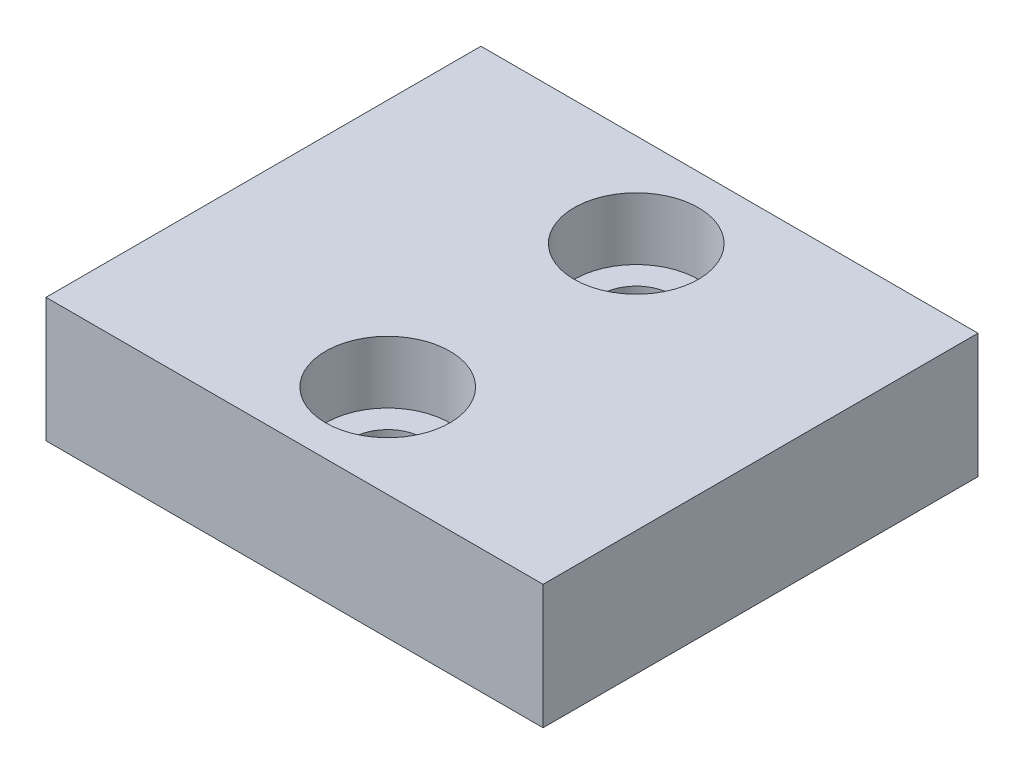
ISO-10303-21;
HEADER;
FILE_DESCRIPTION(('STEP AP214'),'2;1');
FILE_NAME('part.step','',(''),(''),'','','');
FILE_SCHEMA(('AUTOMOTIVE_DESIGN { 1 0 10303 214 1 1 1 1 }'));
ENDSEC;
DATA;
#1=APPLICATION_CONTEXT('core data for automotive mechanical design processes');
#2=APPLICATION_PROTOCOL_DEFINITION('international standard','automotive_design',2000,#1);
#3=PRODUCT_CONTEXT('',#1,'mechanical');
#4=PRODUCT('Part','Part','',(#3));
#5=PRODUCT_RELATED_PRODUCT_CATEGORY('part','',(#4));
#6=PRODUCT_DEFINITION_FORMATION('','',#4);
#7=PRODUCT_DEFINITION_CONTEXT('part definition',#1,'design');
#8=PRODUCT_DEFINITION('design','',#6,#7);
#9=PRODUCT_DEFINITION_SHAPE('','',#8);
#10=(LENGTH_UNIT() NAMED_UNIT(*) SI_UNIT(.MILLI.,.METRE.));
#11=(NAMED_UNIT(*) PLANE_ANGLE_UNIT() SI_UNIT($,.RADIAN.));
#12=(NAMED_UNIT(*) SI_UNIT($,.STERADIAN.) SOLID_ANGLE_UNIT());
#13=UNCERTAINTY_MEASURE_WITH_UNIT(LENGTH_MEASURE(1.E-05),#10,'distance_accuracy_value','');
#14=(GEOMETRIC_REPRESENTATION_CONTEXT(3) GLOBAL_UNCERTAINTY_ASSIGNED_CONTEXT((#13)) GLOBAL_UNIT_ASSIGNED_CONTEXT((#10,
#11,#12)) REPRESENTATION_CONTEXT('',''));
#15=CARTESIAN_POINT('',(0.,0.,0.));
#16=DIRECTION('',(0.,0.,1.));
#17=DIRECTION('',(1.,0.,0.));
#18=AXIS2_PLACEMENT_3D('',#15,#16,#17);
#19=CARTESIAN_POINT('',(0.,4.,4.));
#20=DIRECTION('',(0.,-1.,0.));
#21=DIRECTION('',(0.,0.,-1.));
#22=AXIS2_PLACEMENT_3D('',#19,#20,#21);
#23=CYLINDRICAL_SURFACE('',#22,1.15);
#24=CARTESIAN_POINT('',(0.,0.,4.));
#25=DIRECTION('',(0.,1.,0.));
#26=DIRECTION('',(0.,0.,1.));
#27=AXIS2_PLACEMENT_3D('',#24,#25,#26);
#28=CIRCLE('',#27,1.15);
#29=CARTESIAN_POINT('',(0.,0.,5.15));
#30=VERTEX_POINT('',#29);
#31=EDGE_CURVE('E112',#30,#30,#28,.T.);
#32=ORIENTED_EDGE('',*,*,#31,.F.);
#33=EDGE_LOOP('',(#32));
#34=FACE_BOUND('',#33,.T.);
#35=CARTESIAN_POINT('',(0.,2.,4.));
#36=DIRECTION('',(0.,1.,0.));
#37=DIRECTION('',(0.,0.,1.));
#38=AXIS2_PLACEMENT_3D('',#35,#36,#37);
#39=CIRCLE('',#38,1.15);
#40=CARTESIAN_POINT('',(0.,2.,5.15));
#41=VERTEX_POINT('',#40);
#42=EDGE_CURVE('E39',#41,#41,#39,.T.);
#43=ORIENTED_EDGE('',*,*,#42,.T.);
#44=EDGE_LOOP('',(#43));
#45=FACE_BOUND('',#44,.T.);
#46=ADVANCED_FACE('F35',(#34,#45),#23,.F.);
#47=CARTESIAN_POINT('',(0.,4.,-4.));
#48=DIRECTION('',(0.,-1.,0.));
#49=DIRECTION('',(0.,0.,-1.));
#50=AXIS2_PLACEMENT_3D('',#47,#48,#49);
#51=CYLINDRICAL_SURFACE('',#50,1.15);
#52=CARTESIAN_POINT('',(0.,0.,-4.));
#53=DIRECTION('',(0.,1.,0.));
#54=DIRECTION('',(0.,0.,1.));
#55=AXIS2_PLACEMENT_3D('',#52,#53,#54);
#56=CIRCLE('',#55,1.15);
#57=CARTESIAN_POINT('',(0.,0.,-2.85));
#58=VERTEX_POINT('',#57);
#59=EDGE_CURVE('E105',#58,#58,#56,.T.);
#60=ORIENTED_EDGE('',*,*,#59,.F.);
#61=EDGE_LOOP('',(#60));
#62=FACE_BOUND('',#61,.T.);
#63=CARTESIAN_POINT('',(0.,2.,-4.));
#64=DIRECTION('',(0.,1.,0.));
#65=DIRECTION('',(0.,0.,1.));
#66=AXIS2_PLACEMENT_3D('',#63,#64,#65);
#67=CIRCLE('',#66,1.15);
#68=CARTESIAN_POINT('',(0.,2.,-2.85));
#69=VERTEX_POINT('',#68);
#70=EDGE_CURVE('E110',#69,#69,#67,.T.);
#71=ORIENTED_EDGE('',*,*,#70,.T.);
#72=EDGE_LOOP('',(#71));
#73=FACE_BOUND('',#72,.T.);
#74=ADVANCED_FACE('F133',(#62,#73),#51,.F.);
#75=CARTESIAN_POINT('',(0.,4.,0.));
#76=DIRECTION('',(0.,1.,0.));
#77=DIRECTION('',(0.,0.,1.));
#78=AXIS2_PLACEMENT_3D('',#75,#76,#77);
#79=PLANE('',#78);
#80=CARTESIAN_POINT('',(0.,4.,4.));
#81=DIRECTION('',(0.,1.,0.));
#82=DIRECTION('',(0.,0.,1.));
#83=AXIS2_PLACEMENT_3D('',#80,#81,#82);
#84=CIRCLE('',#83,2.);
#85=CARTESIAN_POINT('',(0.,4.,6.));
#86=VERTEX_POINT('',#85);
#87=EDGE_CURVE('E221',#86,#86,#84,.T.);
#88=ORIENTED_EDGE('',*,*,#87,.F.);
#89=EDGE_LOOP('',(#88));
#90=FACE_BOUND('',#89,.T.);
#91=CARTESIAN_POINT('',(0.,4.,-4.));
#92=DIRECTION('',(0.,1.,0.));
#93=DIRECTION('',(0.,0.,1.));
#94=AXIS2_PLACEMENT_3D('',#91,#92,#93);
#95=CIRCLE('',#94,2.);
#96=CARTESIAN_POINT('',(0.,4.,-2.));
#97=VERTEX_POINT('',#96);
#98=EDGE_CURVE('E119',#97,#97,#95,.T.);
#99=ORIENTED_EDGE('',*,*,#98,.F.);
#100=EDGE_LOOP('',(#99));
#101=FACE_BOUND('',#100,.T.);
#102=DIRECTION('',(0.,0.,1.));
#103=VECTOR('',#102,1.);
#104=CARTESIAN_POINT('',(-8.,4.,-7.));
#105=LINE('',#104,#103);
#106=CARTESIAN_POINT('',(-8.,4.,-7.));
#107=VERTEX_POINT('',#106);
#108=CARTESIAN_POINT('',(-8.,4.,7.));
#109=VERTEX_POINT('',#108);
#110=EDGE_CURVE('E89',#107,#109,#105,.T.);
#111=ORIENTED_EDGE('',*,*,#110,.T.);
#112=DIRECTION('',(1.,0.,0.));
#113=VECTOR('',#112,1.);
#114=CARTESIAN_POINT('',(-8.,4.,7.));
#115=LINE('',#114,#113);
#116=CARTESIAN_POINT('',(8.,4.,7.));
#117=VERTEX_POINT('',#116);
#118=EDGE_CURVE('E84',#109,#117,#115,.T.);
#119=ORIENTED_EDGE('',*,*,#118,.T.);
#120=DIRECTION('',(0.,0.,-1.));
#121=VECTOR('',#120,1.);
#122=CARTESIAN_POINT('',(8.,4.,-7.));
#123=LINE('',#122,#121);
#124=CARTESIAN_POINT('',(8.,4.,-7.));
#125=VERTEX_POINT('',#124);
#126=EDGE_CURVE('E87',#117,#125,#123,.T.);
#127=ORIENTED_EDGE('',*,*,#126,.T.);
#128=DIRECTION('',(-1.,0.,0.));
#129=VECTOR('',#128,1.);
#130=CARTESIAN_POINT('',(-8.,4.,-7.));
#131=LINE('',#130,#129);
#132=EDGE_CURVE('E54',#125,#107,#131,.T.);
#133=ORIENTED_EDGE('',*,*,#132,.T.);
#134=EDGE_LOOP('',(#111,#119,#127,#133));
#135=FACE_BOUND('',#134,.T.);
#136=ADVANCED_FACE('F85',(#90,#101,#135),#79,.T.);
#137=CARTESIAN_POINT('',(0.,0.,0.));
#138=DIRECTION('',(0.,1.,0.));
#139=DIRECTION('',(0.,0.,1.));
#140=AXIS2_PLACEMENT_3D('',#137,#138,#139);
#141=PLANE('',#140);
#142=DIRECTION('',(0.,0.,1.));
#143=VECTOR('',#142,1.);
#144=CARTESIAN_POINT('',(-8.,0.,-7.));
#145=LINE('',#144,#143);
#146=CARTESIAN_POINT('',(-8.,0.,-7.));
#147=VERTEX_POINT('',#146);
#148=CARTESIAN_POINT('',(-8.,0.,7.));
#149=VERTEX_POINT('',#148);
#150=EDGE_CURVE('E102',#147,#149,#145,.T.);
#151=ORIENTED_EDGE('',*,*,#150,.F.);
#152=DIRECTION('',(-1.,0.,0.));
#153=VECTOR('',#152,1.);
#154=CARTESIAN_POINT('',(-8.,0.,-7.));
#155=LINE('',#154,#153);
#156=CARTESIAN_POINT('',(8.,0.,-7.));
#157=VERTEX_POINT('',#156);
#158=EDGE_CURVE('E77',#157,#147,#155,.T.);
#159=ORIENTED_EDGE('',*,*,#158,.F.);
#160=DIRECTION('',(0.,0.,-1.));
#161=VECTOR('',#160,1.);
#162=CARTESIAN_POINT('',(8.,0.,-7.));
#163=LINE('',#162,#161);
#164=CARTESIAN_POINT('',(8.,0.,7.));
#165=VERTEX_POINT('',#164);
#166=EDGE_CURVE('E71',#165,#157,#163,.T.);
#167=ORIENTED_EDGE('',*,*,#166,.F.);
#168=DIRECTION('',(1.,0.,0.));
#169=VECTOR('',#168,1.);
#170=CARTESIAN_POINT('',(-8.,0.,7.));
#171=LINE('',#170,#169);
#172=EDGE_CURVE('E93',#149,#165,#171,.T.);
#173=ORIENTED_EDGE('',*,*,#172,.F.);
#174=EDGE_LOOP('',(#151,#159,#167,#173));
#175=FACE_BOUND('',#174,.T.);
#176=ORIENTED_EDGE('',*,*,#59,.T.);
#177=EDGE_LOOP('',(#176));
#178=FACE_BOUND('',#177,.T.);
#179=ORIENTED_EDGE('',*,*,#31,.T.);
#180=EDGE_LOOP('',(#179));
#181=FACE_BOUND('',#180,.T.);
#182=ADVANCED_FACE('F130',(#175,#178,#181),#141,.F.);
#183=CARTESIAN_POINT('',(-8.,4.,-7.));
#184=DIRECTION('',(1.,0.,0.));
#185=DIRECTION('',(0.,0.,-1.));
#186=AXIS2_PLACEMENT_3D('',#183,#184,#185);
#187=PLANE('',#186);
#188=ORIENTED_EDGE('',*,*,#150,.T.);
#189=DIRECTION('',(0.,-1.,0.));
#190=VECTOR('',#189,1.);
#191=CARTESIAN_POINT('',(-8.,4.,7.));
#192=LINE('',#191,#190);
#193=EDGE_CURVE('E12',#109,#149,#192,.T.);
#194=ORIENTED_EDGE('',*,*,#193,.F.);
#195=ORIENTED_EDGE('',*,*,#110,.F.);
#196=DIRECTION('',(0.,-1.,0.));
#197=VECTOR('',#196,1.);
#198=CARTESIAN_POINT('',(-8.,4.,-7.));
#199=LINE('',#198,#197);
#200=EDGE_CURVE('E98',#107,#147,#199,.T.);
#201=ORIENTED_EDGE('',*,*,#200,.T.);
#202=EDGE_LOOP('',(#188,#194,#195,#201));
#203=FACE_BOUND('',#202,.T.);
#204=ADVANCED_FACE('F37',(#203),#187,.F.);
#205=CARTESIAN_POINT('',(-8.,4.,7.));
#206=DIRECTION('',(0.,0.,-1.));
#207=DIRECTION('',(-1.,0.,0.));
#208=AXIS2_PLACEMENT_3D('',#205,#206,#207);
#209=PLANE('',#208);
#210=ORIENTED_EDGE('',*,*,#172,.T.);
#211=DIRECTION('',(0.,-1.,0.));
#212=VECTOR('',#211,1.);
#213=CARTESIAN_POINT('',(8.,4.,7.));
#214=LINE('',#213,#212);
#215=EDGE_CURVE('E45',#117,#165,#214,.T.);
#216=ORIENTED_EDGE('',*,*,#215,.F.);
#217=ORIENTED_EDGE('',*,*,#118,.F.);
#218=ORIENTED_EDGE('',*,*,#193,.T.);
#219=EDGE_LOOP('',(#210,#216,#217,#218));
#220=FACE_BOUND('',#219,.T.);
#221=ADVANCED_FACE('F92',(#220),#209,.F.);
#222=CARTESIAN_POINT('',(8.,4.,-7.));
#223=DIRECTION('',(-1.,0.,0.));
#224=DIRECTION('',(0.,0.,1.));
#225=AXIS2_PLACEMENT_3D('',#222,#223,#224);
#226=PLANE('',#225);
#227=ORIENTED_EDGE('',*,*,#166,.T.);
#228=DIRECTION('',(0.,-1.,0.));
#229=VECTOR('',#228,1.);
#230=CARTESIAN_POINT('',(8.,4.,-7.));
#231=LINE('',#230,#229);
#232=EDGE_CURVE('E94',#125,#157,#231,.T.);
#233=ORIENTED_EDGE('',*,*,#232,.F.);
#234=ORIENTED_EDGE('',*,*,#126,.F.);
#235=ORIENTED_EDGE('',*,*,#215,.T.);
#236=EDGE_LOOP('',(#227,#233,#234,#235));
#237=FACE_BOUND('',#236,.T.);
#238=ADVANCED_FACE('F96',(#237),#226,.F.);
#239=CARTESIAN_POINT('',(-8.,4.,-7.));
#240=DIRECTION('',(0.,0.,1.));
#241=DIRECTION('',(1.,0.,0.));
#242=AXIS2_PLACEMENT_3D('',#239,#240,#241);
#243=PLANE('',#242);
#244=ORIENTED_EDGE('',*,*,#158,.T.);
#245=ORIENTED_EDGE('',*,*,#200,.F.);
#246=ORIENTED_EDGE('',*,*,#132,.F.);
#247=ORIENTED_EDGE('',*,*,#232,.T.);
#248=EDGE_LOOP('',(#244,#245,#246,#247));
#249=FACE_BOUND('',#248,.T.);
#250=ADVANCED_FACE('F149',(#249),#243,.F.);
#251=CARTESIAN_POINT('',(0.,-5.65685424949238,-4.));
#252=DIRECTION('',(0.,1.,0.));
#253=DIRECTION('',(0.,0.,1.));
#254=AXIS2_PLACEMENT_3D('',#251,#252,#253);
#255=CYLINDRICAL_SURFACE('',#254,2.);
#256=CARTESIAN_POINT('',(0.,2.,-4.));
#257=DIRECTION('',(0.,1.,0.));
#258=DIRECTION('',(0.,0.,1.));
#259=AXIS2_PLACEMENT_3D('',#256,#257,#258);
#260=CIRCLE('',#259,2.);
#261=CARTESIAN_POINT('',(0.,2.,-2.));
#262=VERTEX_POINT('',#261);
#263=EDGE_CURVE('E113',#262,#262,#260,.F.);
#264=ORIENTED_EDGE('',*,*,#263,.T.);
#265=EDGE_LOOP('',(#264));
#266=FACE_BOUND('',#265,.T.);
#267=ORIENTED_EDGE('',*,*,#98,.T.);
#268=EDGE_LOOP('',(#267));
#269=FACE_BOUND('',#268,.T.);
#270=ADVANCED_FACE('F152',(#266,#269),#255,.F.);
#271=CARTESIAN_POINT('',(0.,2.,0.));
#272=DIRECTION('',(0.,1.,0.));
#273=DIRECTION('',(0.,0.,1.));
#274=AXIS2_PLACEMENT_3D('',#271,#272,#273);
#275=PLANE('',#274);
#276=ORIENTED_EDGE('',*,*,#70,.F.);
#277=EDGE_LOOP('',(#276));
#278=FACE_BOUND('',#277,.T.);
#279=ORIENTED_EDGE('',*,*,#263,.F.);
#280=EDGE_LOOP('',(#279));
#281=FACE_BOUND('',#280,.T.);
#282=ADVANCED_FACE('F182',(#278,#281),#275,.T.);
#283=CARTESIAN_POINT('',(0.,-5.65685424949238,4.));
#284=DIRECTION('',(0.,1.,0.));
#285=DIRECTION('',(0.,0.,1.));
#286=AXIS2_PLACEMENT_3D('',#283,#284,#285);
#287=CYLINDRICAL_SURFACE('',#286,2.);
#288=CARTESIAN_POINT('',(0.,2.,4.));
#289=DIRECTION('',(0.,1.,0.));
#290=DIRECTION('',(0.,0.,1.));
#291=AXIS2_PLACEMENT_3D('',#288,#289,#290);
#292=CIRCLE('',#291,2.);
#293=CARTESIAN_POINT('',(0.,2.,6.));
#294=VERTEX_POINT('',#293);
#295=EDGE_CURVE('E220',#294,#294,#292,.F.);
#296=ORIENTED_EDGE('',*,*,#295,.T.);
#297=EDGE_LOOP('',(#296));
#298=FACE_BOUND('',#297,.T.);
#299=ORIENTED_EDGE('',*,*,#87,.T.);
#300=EDGE_LOOP('',(#299));
#301=FACE_BOUND('',#300,.T.);
#302=ADVANCED_FACE('F191',(#298,#301),#287,.F.);
#303=CARTESIAN_POINT('',(0.,2.,0.));
#304=DIRECTION('',(0.,1.,0.));
#305=DIRECTION('',(0.,0.,1.));
#306=AXIS2_PLACEMENT_3D('',#303,#304,#305);
#307=PLANE('',#306);
#308=ORIENTED_EDGE('',*,*,#42,.F.);
#309=EDGE_LOOP('',(#308));
#310=FACE_BOUND('',#309,.T.);
#311=ORIENTED_EDGE('',*,*,#295,.F.);
#312=EDGE_LOOP('',(#311));
#313=FACE_BOUND('',#312,.T.);
#314=ADVANCED_FACE('F201',(#310,#313),#307,.T.);
#315=CLOSED_SHELL('',(#46,#74,#136,#182,#204,#221,#238,#250,#270,#282,#302,#314));
#316=MANIFOLD_SOLID_BREP('B2',#315);
#317=ADVANCED_BREP_SHAPE_REPRESENTATION('',(#18,#316),#14);
#318=SHAPE_DEFINITION_REPRESENTATION(#9,#317);
ENDSEC;
END-ISO-10303-21;
